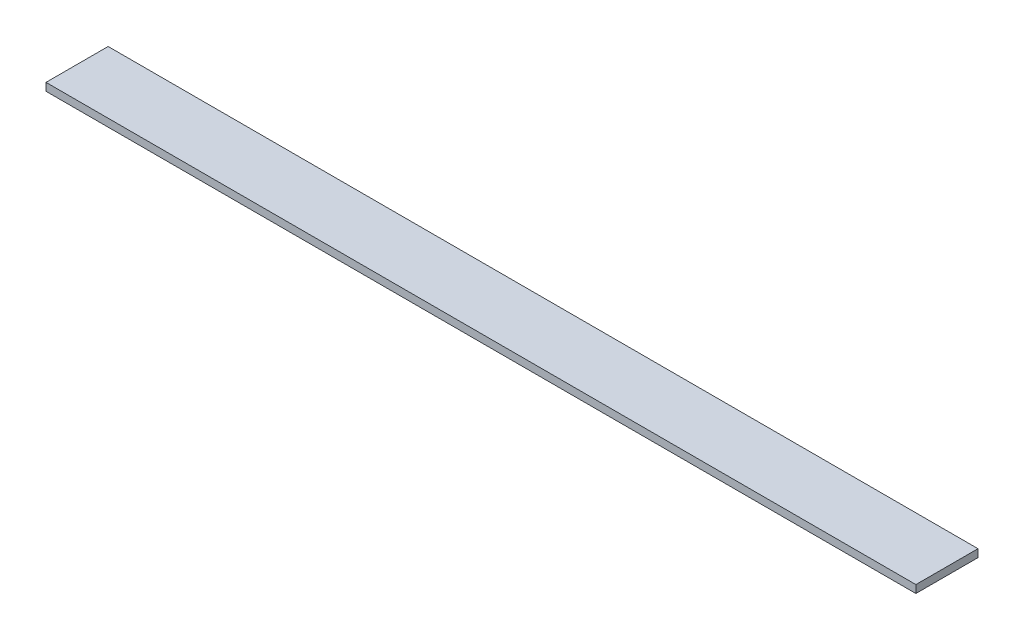
ISO-10303-21;
HEADER;
FILE_DESCRIPTION(('STEP AP214'),'2;1');
FILE_NAME('part.step','',(''),(''),'','','');
FILE_SCHEMA(('AUTOMOTIVE_DESIGN { 1 0 10303 214 1 1 1 1 }'));
ENDSEC;
DATA;
#1=APPLICATION_CONTEXT('core data for automotive mechanical design processes');
#2=APPLICATION_PROTOCOL_DEFINITION('international standard','automotive_design',2000,#1);
#3=PRODUCT_CONTEXT('',#1,'mechanical');
#4=PRODUCT('Part','Part','',(#3));
#5=PRODUCT_RELATED_PRODUCT_CATEGORY('part','',(#4));
#6=PRODUCT_DEFINITION_FORMATION('','',#4);
#7=PRODUCT_DEFINITION_CONTEXT('part definition',#1,'design');
#8=PRODUCT_DEFINITION('design','',#6,#7);
#9=PRODUCT_DEFINITION_SHAPE('','',#8);
#10=(LENGTH_UNIT() NAMED_UNIT(*) SI_UNIT(.MILLI.,.METRE.));
#11=(NAMED_UNIT(*) PLANE_ANGLE_UNIT() SI_UNIT($,.RADIAN.));
#12=(NAMED_UNIT(*) SI_UNIT($,.STERADIAN.) SOLID_ANGLE_UNIT());
#13=UNCERTAINTY_MEASURE_WITH_UNIT(LENGTH_MEASURE(1.E-05),#10,'distance_accuracy_value','');
#14=(GEOMETRIC_REPRESENTATION_CONTEXT(3) GLOBAL_UNCERTAINTY_ASSIGNED_CONTEXT((#13)) GLOBAL_UNIT_ASSIGNED_CONTEXT((#10,
#11,#12)) REPRESENTATION_CONTEXT('',''));
#15=CARTESIAN_POINT('',(0.,0.,0.));
#16=DIRECTION('',(0.,0.,1.));
#17=DIRECTION('',(1.,0.,0.));
#18=AXIS2_PLACEMENT_3D('',#15,#16,#17);
#19=CARTESIAN_POINT('',(177.8,3.175,12.7));
#20=DIRECTION('',(-1.,0.,0.));
#21=DIRECTION('',(0.,0.,1.));
#22=AXIS2_PLACEMENT_3D('',#19,#20,#21);
#23=PLANE('',#22);
#24=DIRECTION('',(0.,0.,-1.));
#25=VECTOR('',#24,1.);
#26=CARTESIAN_POINT('',(177.8,0.,12.7));
#27=LINE('',#26,#25);
#28=CARTESIAN_POINT('',(177.8,0.,12.7));
#29=VERTEX_POINT('',#28);
#30=CARTESIAN_POINT('',(177.8,0.,-12.7));
#31=VERTEX_POINT('',#30);
#32=EDGE_CURVE('E107',#29,#31,#27,.T.);
#33=ORIENTED_EDGE('',*,*,#32,.T.);
#34=DIRECTION('',(0.,-1.,0.));
#35=VECTOR('',#34,1.);
#36=CARTESIAN_POINT('',(177.8,3.175,-12.7));
#37=LINE('',#36,#35);
#38=CARTESIAN_POINT('',(177.8,3.175,-12.7));
#39=VERTEX_POINT('',#38);
#40=EDGE_CURVE('E11',#39,#31,#37,.T.);
#41=ORIENTED_EDGE('',*,*,#40,.F.);
#42=DIRECTION('',(0.,0.,-1.));
#43=VECTOR('',#42,1.);
#44=CARTESIAN_POINT('',(177.8,3.175,12.7));
#45=LINE('',#44,#43);
#46=CARTESIAN_POINT('',(177.8,3.175,12.7));
#47=VERTEX_POINT('',#46);
#48=EDGE_CURVE('E91',#47,#39,#45,.T.);
#49=ORIENTED_EDGE('',*,*,#48,.F.);
#50=DIRECTION('',(0.,-1.,0.));
#51=VECTOR('',#50,1.);
#52=CARTESIAN_POINT('',(177.8,3.175,12.7));
#53=LINE('',#52,#51);
#54=EDGE_CURVE('E103',#47,#29,#53,.T.);
#55=ORIENTED_EDGE('',*,*,#54,.T.);
#56=EDGE_LOOP('',(#33,#41,#49,#55));
#57=FACE_BOUND('',#56,.T.);
#58=ADVANCED_FACE('F39',(#57),#23,.F.);
#59=CARTESIAN_POINT('',(-177.8,3.175,-12.7));
#60=DIRECTION('',(0.,0.,1.));
#61=DIRECTION('',(1.,0.,0.));
#62=AXIS2_PLACEMENT_3D('',#59,#60,#61);
#63=PLANE('',#62);
#64=DIRECTION('',(-1.,0.,0.));
#65=VECTOR('',#64,1.);
#66=CARTESIAN_POINT('',(-177.8,0.,-12.7));
#67=LINE('',#66,#65);
#68=CARTESIAN_POINT('',(-177.8,0.,-12.7));
#69=VERTEX_POINT('',#68);
#70=EDGE_CURVE('E96',#31,#69,#67,.T.);
#71=ORIENTED_EDGE('',*,*,#70,.T.);
#72=DIRECTION('',(0.,-1.,0.));
#73=VECTOR('',#72,1.);
#74=CARTESIAN_POINT('',(-177.8,3.175,-12.7));
#75=LINE('',#74,#73);
#76=CARTESIAN_POINT('',(-177.8,3.175,-12.7));
#77=VERTEX_POINT('',#76);
#78=EDGE_CURVE('E48',#77,#69,#75,.T.);
#79=ORIENTED_EDGE('',*,*,#78,.F.);
#80=DIRECTION('',(-1.,0.,0.));
#81=VECTOR('',#80,1.);
#82=CARTESIAN_POINT('',(-177.8,3.175,-12.7));
#83=LINE('',#82,#81);
#84=EDGE_CURVE('E86',#39,#77,#83,.T.);
#85=ORIENTED_EDGE('',*,*,#84,.F.);
#86=ORIENTED_EDGE('',*,*,#40,.T.);
#87=EDGE_LOOP('',(#71,#79,#85,#86));
#88=FACE_BOUND('',#87,.T.);
#89=ADVANCED_FACE('F95',(#88),#63,.F.);
#90=CARTESIAN_POINT('',(-177.8,3.175,12.7));
#91=DIRECTION('',(1.,0.,0.));
#92=DIRECTION('',(0.,0.,-1.));
#93=AXIS2_PLACEMENT_3D('',#90,#91,#92);
#94=PLANE('',#93);
#95=DIRECTION('',(0.,0.,1.));
#96=VECTOR('',#95,1.);
#97=CARTESIAN_POINT('',(-177.8,0.,12.7));
#98=LINE('',#97,#96);
#99=CARTESIAN_POINT('',(-177.8,0.,12.7));
#100=VERTEX_POINT('',#99);
#101=EDGE_CURVE('E73',#69,#100,#98,.T.);
#102=ORIENTED_EDGE('',*,*,#101,.T.);
#103=DIRECTION('',(0.,-1.,0.));
#104=VECTOR('',#103,1.);
#105=CARTESIAN_POINT('',(-177.8,3.175,12.7));
#106=LINE('',#105,#104);
#107=CARTESIAN_POINT('',(-177.8,3.175,12.7));
#108=VERTEX_POINT('',#107);
#109=EDGE_CURVE('E98',#108,#100,#106,.T.);
#110=ORIENTED_EDGE('',*,*,#109,.F.);
#111=DIRECTION('',(0.,0.,1.));
#112=VECTOR('',#111,1.);
#113=CARTESIAN_POINT('',(-177.8,3.175,12.7));
#114=LINE('',#113,#112);
#115=EDGE_CURVE('E89',#77,#108,#114,.T.);
#116=ORIENTED_EDGE('',*,*,#115,.F.);
#117=ORIENTED_EDGE('',*,*,#78,.T.);
#118=EDGE_LOOP('',(#102,#110,#116,#117));
#119=FACE_BOUND('',#118,.T.);
#120=ADVANCED_FACE('F99',(#119),#94,.F.);
#121=CARTESIAN_POINT('',(-177.8,3.175,12.7));
#122=DIRECTION('',(0.,0.,-1.));
#123=DIRECTION('',(-1.,0.,0.));
#124=AXIS2_PLACEMENT_3D('',#121,#122,#123);
#125=PLANE('',#124);
#126=DIRECTION('',(1.,0.,0.));
#127=VECTOR('',#126,1.);
#128=CARTESIAN_POINT('',(-177.8,0.,12.7));
#129=LINE('',#128,#127);
#130=EDGE_CURVE('E79',#100,#29,#129,.T.);
#131=ORIENTED_EDGE('',*,*,#130,.T.);
#132=ORIENTED_EDGE('',*,*,#54,.F.);
#133=DIRECTION('',(1.,0.,0.));
#134=VECTOR('',#133,1.);
#135=CARTESIAN_POINT('',(-177.8,3.175,12.7));
#136=LINE('',#135,#134);
#137=EDGE_CURVE('E56',#108,#47,#136,.T.);
#138=ORIENTED_EDGE('',*,*,#137,.F.);
#139=ORIENTED_EDGE('',*,*,#109,.T.);
#140=EDGE_LOOP('',(#131,#132,#138,#139));
#141=FACE_BOUND('',#140,.T.);
#142=ADVANCED_FACE('F120',(#141),#125,.F.);
#143=CARTESIAN_POINT('',(0.,3.175,0.));
#144=DIRECTION('',(0.,-1.,0.));
#145=DIRECTION('',(0.,0.,-1.));
#146=AXIS2_PLACEMENT_3D('',#143,#144,#145);
#147=PLANE('',#146);
#148=ORIENTED_EDGE('',*,*,#48,.T.);
#149=ORIENTED_EDGE('',*,*,#84,.T.);
#150=ORIENTED_EDGE('',*,*,#115,.T.);
#151=ORIENTED_EDGE('',*,*,#137,.T.);
#152=EDGE_LOOP('',(#148,#149,#150,#151));
#153=FACE_BOUND('',#152,.T.);
#154=ADVANCED_FACE('F87',(#153),#147,.F.);
#155=CARTESIAN_POINT('',(0.,0.,0.));
#156=DIRECTION('',(0.,-1.,0.));
#157=DIRECTION('',(0.,0.,-1.));
#158=AXIS2_PLACEMENT_3D('',#155,#156,#157);
#159=PLANE('',#158);
#160=ORIENTED_EDGE('',*,*,#32,.F.);
#161=ORIENTED_EDGE('',*,*,#130,.F.);
#162=ORIENTED_EDGE('',*,*,#101,.F.);
#163=ORIENTED_EDGE('',*,*,#70,.F.);
#164=EDGE_LOOP('',(#160,#161,#162,#163));
#165=FACE_BOUND('',#164,.T.);
#166=ADVANCED_FACE('F123',(#165),#159,.T.);
#167=CLOSED_SHELL('',(#58,#89,#120,#142,#154,#166));
#168=MANIFOLD_SOLID_BREP('B2',#167);
#169=ADVANCED_BREP_SHAPE_REPRESENTATION('',(#18,#168),#14);
#170=SHAPE_DEFINITION_REPRESENTATION(#9,#169);
ENDSEC;
END-ISO-10303-21;
